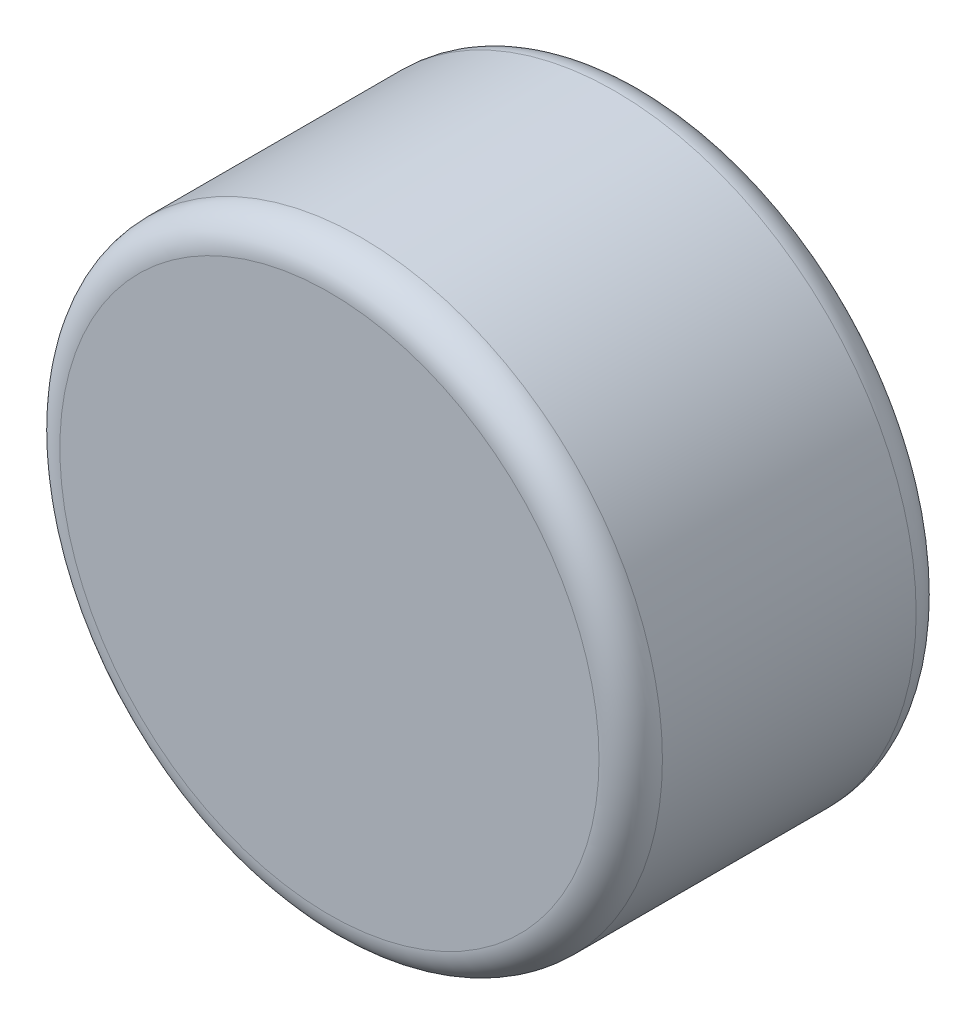
ISO-10303-21;
HEADER;
FILE_DESCRIPTION(('STEP AP214'),'2;1');
FILE_NAME('part.step','',(''),(''),'','','');
FILE_SCHEMA(('AUTOMOTIVE_DESIGN { 1 0 10303 214 1 1 1 1 }'));
ENDSEC;
DATA;
#1=APPLICATION_CONTEXT('core data for automotive mechanical design processes');
#2=APPLICATION_PROTOCOL_DEFINITION('international standard','automotive_design',2000,#1);
#3=PRODUCT_CONTEXT('',#1,'mechanical');
#4=PRODUCT('Part','Part','',(#3));
#5=PRODUCT_RELATED_PRODUCT_CATEGORY('part','',(#4));
#6=PRODUCT_DEFINITION_FORMATION('','',#4);
#7=PRODUCT_DEFINITION_CONTEXT('part definition',#1,'design');
#8=PRODUCT_DEFINITION('design','',#6,#7);
#9=PRODUCT_DEFINITION_SHAPE('','',#8);
#10=(LENGTH_UNIT() NAMED_UNIT(*) SI_UNIT(.MILLI.,.METRE.));
#11=(NAMED_UNIT(*) PLANE_ANGLE_UNIT() SI_UNIT($,.RADIAN.));
#12=(NAMED_UNIT(*) SI_UNIT($,.STERADIAN.) SOLID_ANGLE_UNIT());
#13=UNCERTAINTY_MEASURE_WITH_UNIT(LENGTH_MEASURE(1.E-05),#10,'distance_accuracy_value','');
#14=(GEOMETRIC_REPRESENTATION_CONTEXT(3) GLOBAL_UNCERTAINTY_ASSIGNED_CONTEXT((#13)) GLOBAL_UNIT_ASSIGNED_CONTEXT((#10,
#11,#12)) REPRESENTATION_CONTEXT('',''));
#15=CARTESIAN_POINT('',(0.,0.,0.));
#16=DIRECTION('',(0.,0.,1.));
#17=DIRECTION('',(1.,0.,0.));
#18=AXIS2_PLACEMENT_3D('',#15,#16,#17);
#19=CARTESIAN_POINT('',(0.,0.,-50.));
#20=DIRECTION('',(0.,0.,1.));
#21=DIRECTION('',(-1.,0.,0.));
#22=AXIS2_PLACEMENT_3D('',#19,#20,#21);
#23=CYLINDRICAL_SURFACE('',#22,47.5);
#24=CARTESIAN_POINT('',(0.,0.,-5.));
#25=DIRECTION('',(0.,0.,1.));
#26=DIRECTION('',(1.,0.,0.));
#27=AXIS2_PLACEMENT_3D('',#24,#25,#26);
#28=CIRCLE('',#27,47.5);
#29=CARTESIAN_POINT('',(47.5,0.,-5.));
#30=VERTEX_POINT('',#29);
#31=EDGE_CURVE('E46',#30,#30,#28,.T.);
#32=ORIENTED_EDGE('',*,*,#31,.F.);
#33=EDGE_LOOP('',(#32));
#34=FACE_BOUND('',#33,.T.);
#35=CARTESIAN_POINT('',(0.,0.,-45.));
#36=DIRECTION('',(0.,0.,1.));
#37=DIRECTION('',(1.,0.,0.));
#38=AXIS2_PLACEMENT_3D('',#35,#36,#37);
#39=CIRCLE('',#38,47.5);
#40=CARTESIAN_POINT('',(47.5,0.,-45.));
#41=VERTEX_POINT('',#40);
#42=EDGE_CURVE('E50',#41,#41,#39,.F.);
#43=ORIENTED_EDGE('',*,*,#42,.F.);
#44=EDGE_LOOP('',(#43));
#45=FACE_BOUND('',#44,.T.);
#46=ADVANCED_FACE('F35',(#34,#45),#23,.T.);
#47=CARTESIAN_POINT('',(0.,0.,-50.));
#48=DIRECTION('',(0.,0.,-1.));
#49=DIRECTION('',(1.,0.,0.));
#50=AXIS2_PLACEMENT_3D('',#47,#48,#49);
#51=PLANE('',#50);
#52=CARTESIAN_POINT('',(0.,0.,-50.));
#53=DIRECTION('',(0.,0.,1.));
#54=DIRECTION('',(1.,0.,0.));
#55=AXIS2_PLACEMENT_3D('',#52,#53,#54);
#56=CIRCLE('',#55,42.5);
#57=CARTESIAN_POINT('',(42.5,0.,-50.));
#58=VERTEX_POINT('',#57);
#59=EDGE_CURVE('E10',#58,#58,#56,.T.);
#60=ORIENTED_EDGE('',*,*,#59,.F.);
#61=EDGE_LOOP('',(#60));
#62=FACE_BOUND('',#61,.T.);
#63=ADVANCED_FACE('F58',(#62),#51,.T.);
#64=CARTESIAN_POINT('',(0.,0.,0.));
#65=DIRECTION('',(0.,0.,-1.));
#66=DIRECTION('',(1.,0.,0.));
#67=AXIS2_PLACEMENT_3D('',#64,#65,#66);
#68=PLANE('',#67);
#69=CARTESIAN_POINT('',(0.,0.,0.));
#70=DIRECTION('',(0.,0.,1.));
#71=DIRECTION('',(1.,0.,0.));
#72=AXIS2_PLACEMENT_3D('',#69,#70,#71);
#73=CIRCLE('',#72,42.5);
#74=CARTESIAN_POINT('',(42.5,0.,0.));
#75=VERTEX_POINT('',#74);
#76=EDGE_CURVE('E42',#75,#75,#73,.F.);
#77=ORIENTED_EDGE('',*,*,#76,.F.);
#78=EDGE_LOOP('',(#77));
#79=FACE_BOUND('',#78,.T.);
#80=ADVANCED_FACE('F64',(#79),#68,.F.);
#81=CARTESIAN_POINT('',(0.,0.,-5.));
#82=DIRECTION('',(0.,0.,-1.));
#83=DIRECTION('',(1.,0.,0.));
#84=AXIS2_PLACEMENT_3D('',#81,#82,#83);
#85=TOROIDAL_SURFACE('',#84,42.5,5.);
#86=ORIENTED_EDGE('',*,*,#76,.T.);
#87=EDGE_LOOP('',(#86));
#88=FACE_BOUND('',#87,.T.);
#89=ORIENTED_EDGE('',*,*,#31,.T.);
#90=EDGE_LOOP('',(#89));
#91=FACE_BOUND('',#90,.T.);
#92=ADVANCED_FACE('F69',(#88,#91),#85,.T.);
#93=CARTESIAN_POINT('',(0.,0.,-45.));
#94=DIRECTION('',(0.,0.,-1.));
#95=DIRECTION('',(1.,0.,0.));
#96=AXIS2_PLACEMENT_3D('',#93,#94,#95);
#97=TOROIDAL_SURFACE('',#96,42.5,5.);
#98=ORIENTED_EDGE('',*,*,#42,.T.);
#99=EDGE_LOOP('',(#98));
#100=FACE_BOUND('',#99,.T.);
#101=ORIENTED_EDGE('',*,*,#59,.T.);
#102=EDGE_LOOP('',(#101));
#103=FACE_BOUND('',#102,.T.);
#104=ADVANCED_FACE('F37',(#100,#103),#97,.T.);
#105=CLOSED_SHELL('',(#46,#63,#80,#92,#104));
#106=MANIFOLD_SOLID_BREP('B2',#105);
#107=ADVANCED_BREP_SHAPE_REPRESENTATION('',(#18,#106),#14);
#108=SHAPE_DEFINITION_REPRESENTATION(#9,#107);
ENDSEC;
END-ISO-10303-21;
